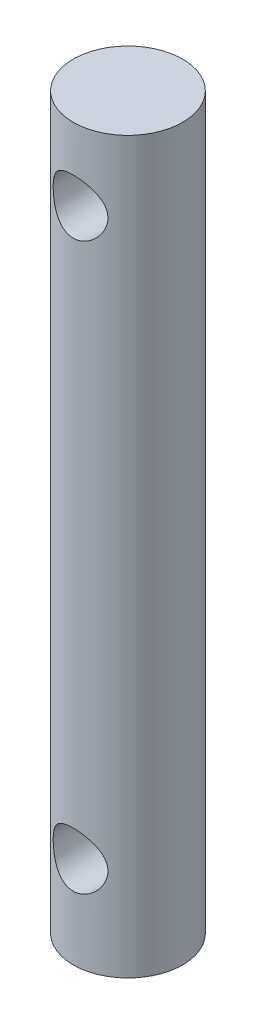
ISO-10303-21;
HEADER;
FILE_DESCRIPTION(('STEP AP214'),'2;1');
FILE_NAME('part.step','',(''),(''),'','','');
FILE_SCHEMA(('AUTOMOTIVE_DESIGN { 1 0 10303 214 1 1 1 1 }'));
ENDSEC;
DATA;
#1=APPLICATION_CONTEXT('core data for automotive mechanical design processes');
#2=APPLICATION_PROTOCOL_DEFINITION('international standard','automotive_design',2000,#1);
#3=PRODUCT_CONTEXT('',#1,'mechanical');
#4=PRODUCT('Part','Part','',(#3));
#5=PRODUCT_RELATED_PRODUCT_CATEGORY('part','',(#4));
#6=PRODUCT_DEFINITION_FORMATION('','',#4);
#7=PRODUCT_DEFINITION_CONTEXT('part definition',#1,'design');
#8=PRODUCT_DEFINITION('design','',#6,#7);
#9=PRODUCT_DEFINITION_SHAPE('','',#8);
#10=(LENGTH_UNIT() NAMED_UNIT(*) SI_UNIT(.MILLI.,.METRE.));
#11=(NAMED_UNIT(*) PLANE_ANGLE_UNIT() SI_UNIT($,.RADIAN.));
#12=(NAMED_UNIT(*) SI_UNIT($,.STERADIAN.) SOLID_ANGLE_UNIT());
#13=UNCERTAINTY_MEASURE_WITH_UNIT(LENGTH_MEASURE(1.E-05),#10,'distance_accuracy_value','');
#14=(GEOMETRIC_REPRESENTATION_CONTEXT(3) GLOBAL_UNCERTAINTY_ASSIGNED_CONTEXT((#13)) GLOBAL_UNIT_ASSIGNED_CONTEXT((#10,
#11,#12)) REPRESENTATION_CONTEXT('',''));
#15=CARTESIAN_POINT('',(0.,0.,0.));
#16=DIRECTION('',(0.,0.,1.));
#17=DIRECTION('',(1.,0.,0.));
#18=AXIS2_PLACEMENT_3D('',#15,#16,#17);
#19=CARTESIAN_POINT('',(0.,20.,0.));
#20=DIRECTION('',(0.,-1.,0.));
#21=DIRECTION('',(0.,0.,-1.));
#22=AXIS2_PLACEMENT_3D('',#19,#20,#21);
#23=CYLINDRICAL_SURFACE('',#22,3.);
#24=CARTESIAN_POINT('',(0.,17.5,-3.));
#25=CARTESIAN_POINT('',(-0.0788579444268501,17.4999950465242,-2.99999570107562));
#26=CARTESIAN_POINT('',(-0.157809899546344,17.4937448903184,-2.99685736529635));
#27=CARTESIAN_POINT('',(-0.313380352903344,17.4690206794877,-2.98461234055735));
#28=CARTESIAN_POINT('',(-0.389994130070444,17.4505234105033,-2.97549431743379));
#29=CARTESIAN_POINT('',(-0.538400317320674,17.4022092870751,-2.95224419105063));
#30=CARTESIAN_POINT('',(-0.61021020440872,17.372436423628,-2.93813158766306));
#31=CARTESIAN_POINT('',(-0.747708925209898,17.3026440679525,-2.90618664773642));
#32=CARTESIAN_POINT('',(-0.813398240985088,17.2626253836267,-2.88835460450288));
#33=CARTESIAN_POINT('',(-0.941261726642864,17.1707241257721,-2.84934387387093));
#34=CARTESIAN_POINT('',(-1.00298281668316,17.1182702811405,-2.82802798691306));
#35=CARTESIAN_POINT('',(-1.11716916730047,17.0042177811294,-2.78489955370114));
#36=CARTESIAN_POINT('',(-1.16962737466015,16.9426122223413,-2.76308664313552));
#37=CARTESIAN_POINT('',(-1.26787800067542,16.8062749757149,-2.71948426796021));
#38=CARTESIAN_POINT('',(-1.31283800332746,16.7308958524811,-2.69782780455198));
#39=CARTESIAN_POINT('',(-1.38925234033604,16.5724489960207,-2.65928968158481));
#40=CARTESIAN_POINT('',(-1.4207163224495,16.4893868069159,-2.64240461410484));
#41=CARTESIAN_POINT('',(-1.46719866328288,16.3230023418671,-2.61686800556713));
#42=CARTESIAN_POINT('',(-1.48308878562066,16.2399933218989,-2.6077840737557));
#43=CARTESIAN_POINT('',(-1.50064048996327,16.0720317433308,-2.59772834922792));
#44=CARTESIAN_POINT('',(-1.50231613255961,15.9870811886933,-2.59674854014932));
#45=CARTESIAN_POINT('',(-1.49203093075844,15.8285709635269,-2.60266395385873));
#46=CARTESIAN_POINT('',(-1.48167683930523,15.7548639531654,-2.6086314549302));
#47=CARTESIAN_POINT('',(-1.4504097735854,15.6104171359404,-2.62614343100775));
#48=CARTESIAN_POINT('',(-1.42949343584648,15.539678282042,-2.63768968247664));
#49=CARTESIAN_POINT('',(-1.37731467057901,15.4011563011515,-2.66531214619111));
#50=CARTESIAN_POINT('',(-1.34582260067399,15.3334804018213,-2.68148760995998));
#51=CARTESIAN_POINT('',(-1.273562531502,15.204048561115,-2.71655106422105));
#52=CARTESIAN_POINT('',(-1.2327903657187,15.1422952965999,-2.73544027170286));
#53=CARTESIAN_POINT('',(-1.13709908236918,15.0182181208852,-2.77669736854929));
#54=CARTESIAN_POINT('',(-1.08104168755392,14.9568146896358,-2.79920265355119));
#55=CARTESIAN_POINT('',(-0.959333368112061,14.8438968721136,-2.84321434950611));
#56=CARTESIAN_POINT('',(-0.893677884861429,14.7923872119492,-2.86472027938201));
#57=CARTESIAN_POINT('',(-0.750774758747774,14.6984715084554,-2.90552980924446));
#58=CARTESIAN_POINT('',(-0.673130387399115,14.6565992913314,-2.92468476243011));
#59=CARTESIAN_POINT('',(-0.510699323233196,14.5868544564355,-2.95736821681863));
#60=CARTESIAN_POINT('',(-0.425918364397914,14.5589707224772,-2.9709011841533));
#61=CARTESIAN_POINT('',(-0.259149737491053,14.520286894425,-2.98986500612153));
#62=CARTESIAN_POINT('',(-0.17751229582249,14.5082631463798,-2.99587407451965));
#63=CARTESIAN_POINT('',(-0.013169399924028,14.4978029032983,-3.00109520188655));
#64=CARTESIAN_POINT('',(0.0695355298048625,14.4993599715408,-3.00031048081978));
#65=CARTESIAN_POINT('',(0.22684945797898,14.5153100326281,-2.99236788380152));
#66=CARTESIAN_POINT('',(0.301589112074894,14.528698799095,-2.98570868532252));
#67=CARTESIAN_POINT('',(0.447610338452911,14.5663571078427,-2.9673325697226));
#68=CARTESIAN_POINT('',(0.51889152853663,14.5906278496802,-2.95561509501618));
#69=CARTESIAN_POINT('',(0.658332912674359,14.6499976996495,-2.92776377120382));
#70=CARTESIAN_POINT('',(0.726345595508705,14.6853865751744,-2.91151322654446));
#71=CARTESIAN_POINT('',(0.855692042548907,14.7656613034699,-2.87615961476126));
#72=CARTESIAN_POINT('',(0.917022944664887,14.8105512018931,-2.85705533350407));
#73=CARTESIAN_POINT('',(1.03765153393382,14.9136406379961,-2.81562332004297));
#74=CARTESIAN_POINT('',(1.09615811672854,14.9727143026677,-2.79316327265249));
#75=CARTESIAN_POINT('',(1.20278448167828,15.0998877269166,-2.7489358741323));
#76=CARTESIAN_POINT('',(1.25089707856781,15.1679936782719,-2.72716901100071));
#77=CARTESIAN_POINT('',(1.33756187171853,15.3154654812595,-2.68576788309734));
#78=CARTESIAN_POINT('',(1.37553824370037,15.3952168991417,-2.66628794383591));
#79=CARTESIAN_POINT('',(1.43712423890206,15.5612651013624,-2.63361108441202));
#80=CARTESIAN_POINT('',(1.46075237380052,15.6475532897003,-2.62040607332625));
#81=CARTESIAN_POINT('',(1.49079253120031,15.8153653343271,-2.60342251538703));
#82=CARTESIAN_POINT('',(1.49863949460818,15.8965513801529,-2.59886075197597));
#83=CARTESIAN_POINT('',(1.5010337315643,16.0591706007468,-2.59748031962405));
#84=CARTESIAN_POINT('',(1.49558676993486,16.1406036531068,-2.60065829439585));
#85=CARTESIAN_POINT('',(1.47288918838996,16.2932252523002,-2.61356793076615));
#86=CARTESIAN_POINT('',(1.45681247151455,16.3646507052171,-2.62264641723988));
#87=CARTESIAN_POINT('',(1.41476303733662,16.5037121791366,-2.64556524281479));
#88=CARTESIAN_POINT('',(1.38878713673988,16.571346973138,-2.65940711354503));
#89=CARTESIAN_POINT('',(1.32572361795085,16.7059372764798,-2.69142795546803));
#90=CARTESIAN_POINT('',(1.28800670672355,16.7725418527435,-2.70983583593881));
#91=CARTESIAN_POINT('',(1.20322645745609,16.8989118042719,-2.74852997452291));
#92=CARTESIAN_POINT('',(1.15615825686234,16.9586735957817,-2.76881720693416));
#93=CARTESIAN_POINT('',(1.04730498999206,17.077212973532,-2.81193484737138));
#94=CARTESIAN_POINT('',(0.984426634495894,17.1349886535254,-2.83477474959942));
#95=CARTESIAN_POINT('',(0.849232209349799,17.2393944751529,-2.87816628389896));
#96=CARTESIAN_POINT('',(0.776911084957798,17.2860186092049,-2.89871667939293));
#97=CARTESIAN_POINT('',(0.62389739517442,17.3668545440681,-2.93547014349806));
#98=CARTESIAN_POINT('',(0.543149255665098,17.4009762538547,-2.95164144740899));
#99=CARTESIAN_POINT('',(0.376113151707131,17.4547122516361,-2.9775201194848));
#100=CARTESIAN_POINT('',(0.28984169938365,17.4743677702086,-2.98724585044602));
#101=CARTESIAN_POINT('',(0.168902919736342,17.4908461166286,-2.99543192870217));
#102=CARTESIAN_POINT('',(0.135242819162347,17.4942739612995,-2.99714048010376));
#103=CARTESIAN_POINT('',(0.0677275977076376,17.4988519982711,-2.99942545465223));
#104=CARTESIAN_POINT('',(0.0338724714699428,17.5000021277053,-3.00000184655071));
#105=CARTESIAN_POINT('',(0.,17.5,-3.));
#106=B_SPLINE_CURVE_WITH_KNOTS('',3,(#24,#25,#26,#27,#28,#29,#30,#31,#32,#33,#34,#35,#36,#37,
#38,#39,#40,#41,#42,#43,#44,#45,#46,#47,#48,#49,#50,#51,#52,#53,#54,#55,#56,#57,#58,#59,#60,#61,
#62,#63,#64,#65,#66,#67,#68,#69,#70,#71,#72,#73,#74,#75,#76,#77,#78,#79,#80,#81,#82,#83,#84,#85,
#86,#87,#88,#89,#90,#91,#92,#93,#94,#95,#96,#97,#98,#99,#100,#101,#102,#103,#104,#105),
.UNSPECIFIED.,.T.,.F.,(4,2,2,2,2,2,2,2,2,2,2,2,2,2,2,2,2,2,2,2,2,2,2,2,2,2,2,2,2,2,2,2,2,2,2,2,
2,2,2,2,4),(0.,0.236436386130438,0.473322224563797,0.709293233238449,0.945245640872351,
1.19547263807713,1.44588935648105,1.71572589646129,1.98536921847421,2.23887018210344,
2.49212035993531,2.7150856861398,2.93812205888517,3.16635360252731,3.39468781890333,
3.65197412000818,3.90938301898029,4.17874533321661,4.44789325368419,4.69474935707018,
4.94148846767214,5.16910359759183,5.39674382446397,5.63089284041848,5.86514176122509,
6.12239415966628,6.37982382923148,6.64972023242589,6.91926767918176,7.1629396125457,
7.40650589797018,7.62686895373284,7.84730293182527,8.08254685170431,8.31791341715446,
8.58187864135757,8.84598575071869,9.1119602049529,9.37717362931724,9.47872920200875,
9.58028757766599),.UNSPECIFIED.);
#107=CARTESIAN_POINT('',(0.,17.5,-3.));
#108=VERTEX_POINT('',#107);
#109=EDGE_CURVE('E10',#108,#108,#106,.T.);
#110=ORIENTED_EDGE('',*,*,#109,.T.);
#111=EDGE_LOOP('',(#110));
#112=FACE_BOUND('',#111,.T.);
#113=CARTESIAN_POINT('',(1.5,16.,2.59807621135332));
#114=CARTESIAN_POINT('',(1.4999945446118,15.9218382877071,2.59808302092689));
#115=CARTESIAN_POINT('',(1.49384995609983,15.8435778827124,2.60165701781635));
#116=CARTESIAN_POINT('',(1.46958481484708,15.6894591029843,2.61543549678079));
#117=CARTESIAN_POINT('',(1.45143909683127,15.6136061274349,2.62565391083339));
#118=CARTESIAN_POINT('',(1.40414992304972,15.4668225034841,2.65124019908098));
#119=CARTESIAN_POINT('',(1.3750649287406,15.3958680212896,2.66658065209878));
#120=CARTESIAN_POINT('',(1.30690128806456,15.2598636970049,2.70063997225287));
#121=CARTESIAN_POINT('',(1.26782210105366,15.1948141746063,2.71935902214097));
#122=CARTESIAN_POINT('',(1.17699981079632,15.0665414071637,2.75995303586162));
#123=CARTESIAN_POINT('',(1.12447805421566,15.0039112964897,2.7819609545693));
#124=CARTESIAN_POINT('',(1.0098807114217,14.8878874173899,2.82557974178558));
#125=CARTESIAN_POINT('',(0.94780038867344,14.8344982561247,2.84719040746875));
#126=CARTESIAN_POINT('',(0.81073434512182,14.7349492732785,2.88932215429423));
#127=CARTESIAN_POINT('',(0.735160783518862,14.6895193482107,2.90967159627259));
#128=CARTESIAN_POINT('',(0.576235539899256,14.6122887201314,2.94526134149293));
#129=CARTESIAN_POINT('',(0.492888807207233,14.5804794157942,2.96050486775612));
#130=CARTESIAN_POINT('',(0.327067415888966,14.5337430080484,2.98320691866356));
#131=CARTESIAN_POINT('',(0.244952685733227,14.5177757104667,2.99114220331338));
#132=CARTESIAN_POINT('',(0.0788559430467726,14.4997508219874,3.000113757691));
#133=CARTESIAN_POINT('',(-0.00512490876560731,14.4976848148064,3.00115420176885));
#134=CARTESIAN_POINT('',(-0.164748786635624,14.5071200109555,2.99644472874675));
#135=CARTESIAN_POINT('',(-0.240481798765187,14.5174570232818,2.99127743838241));
#136=CARTESIAN_POINT('',(-0.388970657877483,14.549321265857,2.97561367889621));
#137=CARTESIAN_POINT('',(-0.461726281640888,14.5708493334643,2.96511681099591));
#138=CARTESIAN_POINT('',(-0.60346408735433,14.6246238491347,2.93957374931482));
#139=CARTESIAN_POINT('',(-0.672380135272767,14.6570144697581,2.92446662293799));
#140=CARTESIAN_POINT('',(-0.803965202269992,14.7313951243022,2.89106468980031));
#141=CARTESIAN_POINT('',(-0.866631973257969,14.7733885949535,2.87276874236226));
#142=CARTESIAN_POINT('',(-0.990260491347293,14.8703430272995,2.83266591598844));
#143=CARTESIAN_POINT('',(-1.05050111254404,14.926154542489,2.81069063997263));
#144=CARTESIAN_POINT('',(-1.16115655544667,15.0468845873953,2.76681510880217));
#145=CARTESIAN_POINT('',(-1.21156381736135,15.1118100584111,2.74491492398443));
#146=CARTESIAN_POINT('',(-1.30425800196332,15.2539722886361,2.70216234138727));
#147=CARTESIAN_POINT('',(-1.34582597246708,15.3317290345813,2.68146479986061));
#148=CARTESIAN_POINT('',(-1.41497866950185,15.4944065070385,2.64563175417864));
#149=CARTESIAN_POINT('',(-1.44257798731634,15.5793196495263,2.63049045069101));
#150=CARTESIAN_POINT('',(-1.48077031653756,15.7468217669242,2.60916953725551));
#151=CARTESIAN_POINT('',(-1.49253768317996,15.8290616785653,2.60237483772744));
#152=CARTESIAN_POINT('',(-1.50227541991714,15.9946020122748,2.59676879042414));
#153=CARTESIAN_POINT('',(-1.50025553597254,16.0779016436797,2.59795180333967));
#154=CARTESIAN_POINT('',(-1.48355406501595,16.2334808778681,2.60751504810877));
#155=CARTESIAN_POINT('',(-1.4702817250687,16.3059691766619,2.61509381259981));
#156=CARTESIAN_POINT('',(-1.43354442694866,16.4475516794064,2.63541032327011));
#157=CARTESIAN_POINT('',(-1.41007616793542,16.5166447761199,2.64814974007551));
#158=CARTESIAN_POINT('',(-1.35247138290733,16.653116996354,2.67804333119485));
#159=CARTESIAN_POINT('',(-1.31789109553909,16.7202685252803,2.69537464864595));
#160=CARTESIAN_POINT('',(-1.23943059602371,16.8482039073085,2.73234179245874));
#161=CARTESIAN_POINT('',(-1.19554560649832,16.9089844652699,2.75197880032721));
#162=CARTESIAN_POINT('',(-1.09325575079828,17.0304681512853,2.79431997684504));
#163=CARTESIAN_POINT('',(-1.03371790847245,17.0901957260765,2.81709874731433));
#164=CARTESIAN_POINT('',(-0.905106743097434,17.1991183569904,2.86101352466839));
#165=CARTESIAN_POINT('',(-0.836030211983022,17.2483098553458,2.88214897511564));
#166=CARTESIAN_POINT('',(-0.687803043838137,17.3358605889252,2.92112042536435));
#167=CARTESIAN_POINT('',(-0.608434646361171,17.3738996773164,2.93885462508044));
#168=CARTESIAN_POINT('',(-0.443283546961624,17.4357068557861,2.96825032438951));
#169=CARTESIAN_POINT('',(-0.357506552088265,17.4594874770495,2.97991715514559));
#170=CARTESIAN_POINT('',(-0.190469523495627,17.490052846262,2.99501262272824));
#171=CARTESIAN_POINT('',(-0.109517165775687,17.4981968138142,2.99909891862287));
#172=CARTESIAN_POINT('',(0.0526889789268045,17.5012648981816,3.00063195562697));
#173=CARTESIAN_POINT('',(0.133942650442629,17.4961936427854,2.99808102100335));
#174=CARTESIAN_POINT('',(0.28880698847572,17.4738753898066,2.98700953256884));
#175=CARTESIAN_POINT('',(0.362568476716895,17.4574527261135,2.97889342001985));
#176=CARTESIAN_POINT('',(0.506168928275426,17.4140095010455,2.95788140495135));
#177=CARTESIAN_POINT('',(0.576007327433263,17.3869874198598,2.94498481699193));
#178=CARTESIAN_POINT('',(0.713135109367326,17.321909421751,2.9148889612218));
#179=CARTESIAN_POINT('',(0.780187714050068,17.2834310151882,2.89752925798199));
#180=CARTESIAN_POINT('',(0.907161962721036,17.1970631037114,2.86032199712739));
#181=CARTESIAN_POINT('',(0.96708031112236,17.1491692763265,2.84047329837541));
#182=CARTESIAN_POINT('',(1.08437100623534,17.0398042914659,2.79792915339941));
#183=CARTESIAN_POINT('',(1.14089652680891,16.9774562687842,2.77514698517547));
#184=CARTESIAN_POINT('',(1.24299493109201,16.8438239183053,2.73094614244278));
#185=CARTESIAN_POINT('',(1.28855812501509,16.7725317686985,2.70952868642798));
#186=CARTESIAN_POINT('',(1.36864661967848,16.6200450301286,2.66999407957374));
#187=CARTESIAN_POINT('',(1.40277759894141,16.5386087033069,2.65200261384405));
#188=CARTESIAN_POINT('',(1.45631806425962,16.3700013934903,2.62299234492527));
#189=CARTESIAN_POINT('',(1.47577678676302,16.282850666631,2.61195024221553));
#190=CARTESIAN_POINT('',(1.49155051179662,16.162291966522,2.60293908902686));
#191=CARTESIAN_POINT('',(1.49471415744578,16.1299481584032,2.60112193507727));
#192=CARTESIAN_POINT('',(1.49894010763494,16.0650752789766,2.59868903831625));
#193=CARTESIAN_POINT('',(1.50000227159981,16.0325461954212,2.59807337587664));
#194=CARTESIAN_POINT('',(1.5,16.,2.59807621135332));
#195=B_SPLINE_CURVE_WITH_KNOTS('',3,(#113,#114,#115,#116,#117,#118,#119,#120,#121,#122,#123,
#124,#125,#126,#127,#128,#129,#130,#131,#132,#133,#134,#135,#136,#137,#138,#139,#140,#141,#142,
#143,#144,#145,#146,#147,#148,#149,#150,#151,#152,#153,#154,#155,#156,#157,#158,#159,#160,#161,
#162,#163,#164,#165,#166,#167,#168,#169,#170,#171,#172,#173,#174,#175,#176,#177,#178,#179,#180,
#181,#182,#183,#184,#185,#186,#187,#188,#189,#190,#191,#192,#193,#194),.UNSPECIFIED.,.T.,.F.,(4,
2,2,2,2,2,2,2,2,2,2,2,2,2,2,2,2,2,2,2,2,2,2,2,2,2,2,2,2,2,2,2,2,2,2,2,2,2,2,2,4),(0.,
0.234348183892075,0.469189339237207,0.702792893878329,0.936409088167724,1.18929346874735,
1.44230356626557,1.71236838358145,1.98226240445837,2.23295227451903,2.4834903552906,
2.71224146226808,2.94100968776183,3.1729430209672,3.40495949025408,3.65890787185336,
3.91305072368878,4.18333262594173,4.45333161317558,4.70193436281318,4.9503613978256,
5.17161275136038,5.39293578654095,5.62450944609132,5.85620229330071,6.1171011537092,
6.37808797467303,6.64596272119449,6.91360169713157,7.1566840558423,7.39968130190957,
7.62666637307239,7.8536840026802,8.09041126079208,8.32724745151079,8.58765362775102,
8.84828914267731,9.11716123557908,9.38512699504141,9.48270202777964,9.58028358741811),.UNSPECIFIED.);
#196=CARTESIAN_POINT('',(1.5,16.,2.59807621135332));
#197=VERTEX_POINT('',#196);
#198=EDGE_CURVE('E42',#197,#197,#195,.T.);
#199=ORIENTED_EDGE('',*,*,#198,.T.);
#200=EDGE_LOOP('',(#199));
#201=FACE_BOUND('',#200,.T.);
#202=CARTESIAN_POINT('',(0.,-13.5,-3.));
#203=CARTESIAN_POINT('',(-0.0788579444268503,-13.5000049534758,-2.99999570107562));
#204=CARTESIAN_POINT('',(-0.157809899546344,-13.5062551096816,-2.99685736529635));
#205=CARTESIAN_POINT('',(-0.313380352903344,-13.5309793205123,-2.98461234055735));
#206=CARTESIAN_POINT('',(-0.389994130070444,-13.5494765894967,-2.97549431743379));
#207=CARTESIAN_POINT('',(-0.538400317320673,-13.5977907129249,-2.95224419105063));
#208=CARTESIAN_POINT('',(-0.610210204408719,-13.627563576372,-2.93813158766306));
#209=CARTESIAN_POINT('',(-0.747708925209898,-13.6973559320475,-2.90618664773642));
#210=CARTESIAN_POINT('',(-0.813398240985089,-13.7373746163733,-2.88835460450288));
#211=CARTESIAN_POINT('',(-0.941261726642864,-13.8292758742279,-2.84934387387093));
#212=CARTESIAN_POINT('',(-1.00298281668316,-13.8817297188595,-2.82802798691306));
#213=CARTESIAN_POINT('',(-1.11716916730047,-13.9957822188706,-2.78489955370114));
#214=CARTESIAN_POINT('',(-1.16962737466015,-14.0573877776587,-2.76308664313552));
#215=CARTESIAN_POINT('',(-1.26787800067542,-14.1937250242851,-2.71948426796021));
#216=CARTESIAN_POINT('',(-1.31283800332746,-14.2691041475189,-2.69782780455198));
#217=CARTESIAN_POINT('',(-1.38925234033604,-14.4275510039793,-2.65928968158481));
#218=CARTESIAN_POINT('',(-1.4207163224495,-14.5106131930841,-2.64240461410484));
#219=CARTESIAN_POINT('',(-1.46719866328288,-14.6769976581329,-2.61686800556713));
#220=CARTESIAN_POINT('',(-1.48308878562066,-14.7600066781011,-2.6077840737557));
#221=CARTESIAN_POINT('',(-1.50064048996327,-14.9279682566692,-2.59772834922792));
#222=CARTESIAN_POINT('',(-1.50231613255961,-15.0129188113067,-2.59674854014932));
#223=CARTESIAN_POINT('',(-1.49203093075844,-15.1714290364731,-2.60266395385873));
#224=CARTESIAN_POINT('',(-1.48167683930523,-15.2451360468346,-2.6086314549302));
#225=CARTESIAN_POINT('',(-1.4504097735854,-15.3895828640596,-2.62614343100775));
#226=CARTESIAN_POINT('',(-1.42949343584648,-15.460321717958,-2.63768968247664));
#227=CARTESIAN_POINT('',(-1.37731467057901,-15.5988436988485,-2.66531214619111));
#228=CARTESIAN_POINT('',(-1.34582260067399,-15.6665195981787,-2.68148760995998));
#229=CARTESIAN_POINT('',(-1.27356253150201,-15.795951438885,-2.71655106422105));
#230=CARTESIAN_POINT('',(-1.2327903657187,-15.8577047034001,-2.73544027170286));
#231=CARTESIAN_POINT('',(-1.13709908236918,-15.9817818791148,-2.77669736854929));
#232=CARTESIAN_POINT('',(-1.08104168755392,-16.0431853103642,-2.79920265355119));
#233=CARTESIAN_POINT('',(-0.959333368112062,-16.1561031278864,-2.84321434950611));
#234=CARTESIAN_POINT('',(-0.893677884861429,-16.2076127880508,-2.86472027938201));
#235=CARTESIAN_POINT('',(-0.750774758747773,-16.3015284915446,-2.90552980924446));
#236=CARTESIAN_POINT('',(-0.673130387399113,-16.3434007086686,-2.92468476243011));
#237=CARTESIAN_POINT('',(-0.510699323233195,-16.4131455435645,-2.95736821681863));
#238=CARTESIAN_POINT('',(-0.425918364397914,-16.4410292775228,-2.9709011841533));
#239=CARTESIAN_POINT('',(-0.259149737491053,-16.479713105575,-2.98986500612153));
#240=CARTESIAN_POINT('',(-0.177512295822489,-16.4917368536202,-2.99587407451965));
#241=CARTESIAN_POINT('',(-0.013169399924027,-16.5021970967017,-3.00109520188655));
#242=CARTESIAN_POINT('',(0.0695355298048635,-16.5006400284592,-3.00031048081978));
#243=CARTESIAN_POINT('',(0.226849457978981,-16.4846899673719,-2.99236788380152));
#244=CARTESIAN_POINT('',(0.301589112074895,-16.471301200905,-2.98570868532252));
#245=CARTESIAN_POINT('',(0.447610338452911,-16.4336428921573,-2.9673325697226));
#246=CARTESIAN_POINT('',(0.51889152853663,-16.4093721503198,-2.95561509501618));
#247=CARTESIAN_POINT('',(0.658332912674359,-16.3500023003504,-2.92776377120382));
#248=CARTESIAN_POINT('',(0.726345595508705,-16.3146134248256,-2.91151322654446));
#249=CARTESIAN_POINT('',(0.855692042548908,-16.2343386965301,-2.87615961476126));
#250=CARTESIAN_POINT('',(0.917022944664888,-16.1894487981069,-2.85705533350407));
#251=CARTESIAN_POINT('',(1.03765153393382,-16.0863593620039,-2.81562332004297));
#252=CARTESIAN_POINT('',(1.09615811672854,-16.0272856973323,-2.79316327265249));
#253=CARTESIAN_POINT('',(1.20278448167828,-15.9001122730834,-2.7489358741323));
#254=CARTESIAN_POINT('',(1.25089707856781,-15.8320063217281,-2.7271690110007));
#255=CARTESIAN_POINT('',(1.33756187171853,-15.6845345187405,-2.68576788309734));
#256=CARTESIAN_POINT('',(1.37553824370037,-15.6047831008583,-2.66628794383591));
#257=CARTESIAN_POINT('',(1.43712423890206,-15.4387348986375,-2.63361108441202));
#258=CARTESIAN_POINT('',(1.46075237380053,-15.3524467102997,-2.62040607332625));
#259=CARTESIAN_POINT('',(1.49079253120031,-15.1846346656729,-2.60342251538703));
#260=CARTESIAN_POINT('',(1.49863949460818,-15.1034486198471,-2.59886075197597));
#261=CARTESIAN_POINT('',(1.5010337315643,-14.9408293992532,-2.59748031962405));
#262=CARTESIAN_POINT('',(1.49558676993486,-14.8593963468932,-2.60065829439585));
#263=CARTESIAN_POINT('',(1.47288918838996,-14.7067747476998,-2.61356793076615));
#264=CARTESIAN_POINT('',(1.45681247151455,-14.6353492947829,-2.62264641723988));
#265=CARTESIAN_POINT('',(1.41476303733662,-14.4962878208634,-2.64556524281479));
#266=CARTESIAN_POINT('',(1.38878713673988,-14.428653026862,-2.65940711354503));
#267=CARTESIAN_POINT('',(1.32572361795085,-14.2940627235202,-2.69142795546803));
#268=CARTESIAN_POINT('',(1.28800670672355,-14.2274581472565,-2.70983583593881));
#269=CARTESIAN_POINT('',(1.20322645745609,-14.1010881957281,-2.74852997452291));
#270=CARTESIAN_POINT('',(1.15615825686234,-14.0413264042183,-2.76881720693416));
#271=CARTESIAN_POINT('',(1.04730498999206,-13.922787026468,-2.81193484737138));
#272=CARTESIAN_POINT('',(0.984426634495892,-13.8650113464746,-2.83477474959942));
#273=CARTESIAN_POINT('',(0.849232209349796,-13.7606055248471,-2.87816628389896));
#274=CARTESIAN_POINT('',(0.776911084957796,-13.7139813907951,-2.89871667939293));
#275=CARTESIAN_POINT('',(0.623897395174418,-13.6331454559319,-2.93547014349806));
#276=CARTESIAN_POINT('',(0.543149255665095,-13.5990237461453,-2.95164144740899));
#277=CARTESIAN_POINT('',(0.376113151707129,-13.5452877483639,-2.9775201194848));
#278=CARTESIAN_POINT('',(0.28984169938365,-13.5256322297914,-2.98724585044602));
#279=CARTESIAN_POINT('',(0.168902919736343,-13.5091538833714,-2.99543192870217));
#280=CARTESIAN_POINT('',(0.135242819162348,-13.5057260387005,-2.99714048010376));
#281=CARTESIAN_POINT('',(0.067727597707638,-13.5011480017289,-2.99942545465223));
#282=CARTESIAN_POINT('',(0.033872471469943,-13.4999978722947,-3.00000184655071));
#283=CARTESIAN_POINT('',(0.,-13.5,-3.));
#284=B_SPLINE_CURVE_WITH_KNOTS('',3,(#202,#203,#204,#205,#206,#207,#208,#209,#210,#211,#212,
#213,#214,#215,#216,#217,#218,#219,#220,#221,#222,#223,#224,#225,#226,#227,#228,#229,#230,#231,
#232,#233,#234,#235,#236,#237,#238,#239,#240,#241,#242,#243,#244,#245,#246,#247,#248,#249,#250,
#251,#252,#253,#254,#255,#256,#257,#258,#259,#260,#261,#262,#263,#264,#265,#266,#267,#268,#269,
#270,#271,#272,#273,#274,#275,#276,#277,#278,#279,#280,#281,#282,#283),.UNSPECIFIED.,.T.,.F.,(4,
2,2,2,2,2,2,2,2,2,2,2,2,2,2,2,2,2,2,2,2,2,2,2,2,2,2,2,2,2,2,2,2,2,2,2,2,2,2,2,4),(0.,
0.236436386130439,0.473322224563796,0.709293233238447,0.945245640872352,1.19547263807713,
1.44588935648105,1.71572589646129,1.98536921847421,2.23887018210344,2.49212035993531,
2.71508568613981,2.93812205888518,3.16635360252731,3.39468781890332,3.65197412000818,
3.90938301898029,4.17874533321661,4.44789325368419,4.69474935707018,4.94148846767214,
5.16910359759183,5.39674382446397,5.63089284041848,5.86514176122509,6.12239415966628,
6.37982382923148,6.64972023242589,6.91926767918176,7.1629396125457,7.40650589797018,
7.62686895373284,7.84730293182527,8.08254685170431,8.31791341715446,8.58187864135757,
8.84598575071869,9.1119602049529,9.37717362931724,9.47872920200875,9.58028757766599),.UNSPECIFIED.);
#285=CARTESIAN_POINT('',(0.,-13.5,-3.));
#286=VERTEX_POINT('',#285);
#287=EDGE_CURVE('E46',#286,#286,#284,.T.);
#288=ORIENTED_EDGE('',*,*,#287,.T.);
#289=EDGE_LOOP('',(#288));
#290=FACE_BOUND('',#289,.T.);
#291=CARTESIAN_POINT('',(1.5,-15.,2.59807621135332));
#292=CARTESIAN_POINT('',(1.4999945446118,-15.0781617122929,2.59808302092689));
#293=CARTESIAN_POINT('',(1.49384995609983,-15.1564221172876,2.60165701781635));
#294=CARTESIAN_POINT('',(1.46958481484708,-15.3105408970157,2.61543549678079));
#295=CARTESIAN_POINT('',(1.45143909683127,-15.3863938725651,2.62565391083339));
#296=CARTESIAN_POINT('',(1.40414992304972,-15.5331774965159,2.65124019908098));
#297=CARTESIAN_POINT('',(1.3750649287406,-15.6041319787104,2.66658065209878));
#298=CARTESIAN_POINT('',(1.30690128806456,-15.7401363029951,2.70063997225287));
#299=CARTESIAN_POINT('',(1.26782210105366,-15.8051858253937,2.71935902214097));
#300=CARTESIAN_POINT('',(1.17699981079632,-15.9334585928363,2.75995303586162));
#301=CARTESIAN_POINT('',(1.12447805421566,-15.9960887035103,2.7819609545693));
#302=CARTESIAN_POINT('',(1.0098807114217,-16.1121125826101,2.82557974178558));
#303=CARTESIAN_POINT('',(0.947800388673439,-16.1655017438753,2.84719040746875));
#304=CARTESIAN_POINT('',(0.810734345121819,-16.2650507267215,2.88932215429424));
#305=CARTESIAN_POINT('',(0.735160783518862,-16.3104806517893,2.90967159627259));
#306=CARTESIAN_POINT('',(0.576235539899256,-16.3877112798686,2.94526134149293));
#307=CARTESIAN_POINT('',(0.492888807207234,-16.4195205842058,2.96050486775612));
#308=CARTESIAN_POINT('',(0.327067415888967,-16.4662569919516,2.98320691866356));
#309=CARTESIAN_POINT('',(0.244952685733227,-16.4822242895333,2.99114220331338));
#310=CARTESIAN_POINT('',(0.0788559430467726,-16.5002491780126,3.000113757691));
#311=CARTESIAN_POINT('',(-0.00512490876560765,-16.5023151851936,3.00115420176885));
#312=CARTESIAN_POINT('',(-0.164748786635625,-16.4928799890445,2.99644472874675));
#313=CARTESIAN_POINT('',(-0.240481798765187,-16.4825429767182,2.99127743838241));
#314=CARTESIAN_POINT('',(-0.388970657877483,-16.450678734143,2.97561367889621));
#315=CARTESIAN_POINT('',(-0.461726281640888,-16.4291506665357,2.96511681099591));
#316=CARTESIAN_POINT('',(-0.60346408735433,-16.3753761508653,2.93957374931482));
#317=CARTESIAN_POINT('',(-0.672380135272767,-16.3429855302419,2.92446662293799));
#318=CARTESIAN_POINT('',(-0.803965202269992,-16.2686048756978,2.89106468980031));
#319=CARTESIAN_POINT('',(-0.866631973257968,-16.2266114050465,2.87276874236226));
#320=CARTESIAN_POINT('',(-0.990260491347292,-16.1296569727005,2.83266591598844));
#321=CARTESIAN_POINT('',(-1.05050111254404,-16.073845457511,2.81069063997263));
#322=CARTESIAN_POINT('',(-1.16115655544667,-15.9531154126047,2.76681510880217));
#323=CARTESIAN_POINT('',(-1.21156381736135,-15.8881899415889,2.74491492398443));
#324=CARTESIAN_POINT('',(-1.30425800196332,-15.7460277113639,2.70216234138727));
#325=CARTESIAN_POINT('',(-1.34582597246708,-15.6682709654187,2.68146479986061));
#326=CARTESIAN_POINT('',(-1.41497866950185,-15.5055934929615,2.64563175417864));
#327=CARTESIAN_POINT('',(-1.44257798731633,-15.4206803504737,2.63049045069101));
#328=CARTESIAN_POINT('',(-1.48077031653756,-15.2531782330758,2.60916953725551));
#329=CARTESIAN_POINT('',(-1.49253768317996,-15.1709383214347,2.60237483772744));
#330=CARTESIAN_POINT('',(-1.50227541991714,-15.0053979877252,2.59676879042414));
#331=CARTESIAN_POINT('',(-1.50025553597254,-14.9220983563203,2.59795180333967));
#332=CARTESIAN_POINT('',(-1.48355406501595,-14.7665191221319,2.60751504810877));
#333=CARTESIAN_POINT('',(-1.4702817250687,-14.6940308233381,2.61509381259981));
#334=CARTESIAN_POINT('',(-1.43354442694866,-14.5524483205936,2.63541032327011));
#335=CARTESIAN_POINT('',(-1.41007616793542,-14.4833552238801,2.64814974007551));
#336=CARTESIAN_POINT('',(-1.35247138290733,-14.346883003646,2.67804333119485));
#337=CARTESIAN_POINT('',(-1.31789109553909,-14.2797314747197,2.69537464864595));
#338=CARTESIAN_POINT('',(-1.23943059602371,-14.1517960926915,2.73234179245874));
#339=CARTESIAN_POINT('',(-1.19554560649832,-14.0910155347301,2.75197880032721));
#340=CARTESIAN_POINT('',(-1.09325575079828,-13.9695318487147,2.79431997684504));
#341=CARTESIAN_POINT('',(-1.03371790847245,-13.9098042739235,2.81709874731433));
#342=CARTESIAN_POINT('',(-0.905106743097434,-13.8008816430096,2.86101352466839));
#343=CARTESIAN_POINT('',(-0.836030211983022,-13.7516901446542,2.88214897511564));
#344=CARTESIAN_POINT('',(-0.687803043838138,-13.6641394110748,2.92112042536435));
#345=CARTESIAN_POINT('',(-0.608434646361172,-13.6261003226836,2.93885462508044));
#346=CARTESIAN_POINT('',(-0.443283546961626,-13.5642931442139,2.96825032438951));
#347=CARTESIAN_POINT('',(-0.357506552088266,-13.5405125229505,2.97991715514559));
#348=CARTESIAN_POINT('',(-0.190469523495627,-13.509947153738,2.99501262272824));
#349=CARTESIAN_POINT('',(-0.109517165775687,-13.5018031861858,2.99909891862287));
#350=CARTESIAN_POINT('',(0.0526889789268044,-13.4987351018184,3.00063195562697));
#351=CARTESIAN_POINT('',(0.133942650442629,-13.5038063572147,2.99808102100335));
#352=CARTESIAN_POINT('',(0.28880698847572,-13.5261246101934,2.98700953256884));
#353=CARTESIAN_POINT('',(0.362568476716895,-13.5425472738865,2.97889342001985));
#354=CARTESIAN_POINT('',(0.506168928275426,-13.5859904989545,2.95788140495135));
#355=CARTESIAN_POINT('',(0.576007327433262,-13.6130125801402,2.94498481699193));
#356=CARTESIAN_POINT('',(0.713135109367326,-13.678090578249,2.9148889612218));
#357=CARTESIAN_POINT('',(0.780187714050068,-13.7165689848118,2.89752925798199));
#358=CARTESIAN_POINT('',(0.907161962721036,-13.8029368962886,2.86032199712739));
#359=CARTESIAN_POINT('',(0.96708031112236,-13.8508307236735,2.84047329837541));
#360=CARTESIAN_POINT('',(1.08437100623534,-13.9601957085341,2.79792915339941));
#361=CARTESIAN_POINT('',(1.14089652680891,-14.0225437312158,2.77514698517547));
#362=CARTESIAN_POINT('',(1.24299493109201,-14.1561760816947,2.73094614244278));
#363=CARTESIAN_POINT('',(1.28855812501509,-14.2274682313015,2.70952868642798));
#364=CARTESIAN_POINT('',(1.36864661967848,-14.3799549698714,2.66999407957374));
#365=CARTESIAN_POINT('',(1.40277759894141,-14.4613912966931,2.65200261384405));
#366=CARTESIAN_POINT('',(1.45631806425962,-14.6299986065097,2.62299234492527));
#367=CARTESIAN_POINT('',(1.47577678676302,-14.717149333369,2.61195024221553));
#368=CARTESIAN_POINT('',(1.49155051179662,-14.837708033478,2.60293908902686));
#369=CARTESIAN_POINT('',(1.49471415744578,-14.8700518415968,2.60112193507727));
#370=CARTESIAN_POINT('',(1.49894010763494,-14.9349247210234,2.59868903831625));
#371=CARTESIAN_POINT('',(1.50000227159981,-14.9674538045788,2.59807337587664));
#372=CARTESIAN_POINT('',(1.5,-15.,2.59807621135332));
#373=B_SPLINE_CURVE_WITH_KNOTS('',3,(#291,#292,#293,#294,#295,#296,#297,#298,#299,#300,#301,
#302,#303,#304,#305,#306,#307,#308,#309,#310,#311,#312,#313,#314,#315,#316,#317,#318,#319,#320,
#321,#322,#323,#324,#325,#326,#327,#328,#329,#330,#331,#332,#333,#334,#335,#336,#337,#338,#339,
#340,#341,#342,#343,#344,#345,#346,#347,#348,#349,#350,#351,#352,#353,#354,#355,#356,#357,#358,
#359,#360,#361,#362,#363,#364,#365,#366,#367,#368,#369,#370,#371,#372),.UNSPECIFIED.,.T.,.F.,(4,
2,2,2,2,2,2,2,2,2,2,2,2,2,2,2,2,2,2,2,2,2,2,2,2,2,2,2,2,2,2,2,2,2,2,2,2,2,2,2,4),(0.,
0.234348183892073,0.469189339237207,0.702792893878327,0.936409088167727,1.18929346874735,
1.44230356626557,1.71236838358145,1.98226240445836,2.23295227451903,2.4834903552906,
2.71224146226808,2.94100968776183,3.1729430209672,3.40495949025408,3.65890787185336,
3.91305072368878,4.18333262594173,4.45333161317557,4.70193436281318,4.95036139782559,
5.17161275136038,5.39293578654094,5.62450944609131,5.85620229330071,6.1171011537092,
6.37808797467303,6.64596272119448,6.91360169713157,7.1566840558423,7.39968130190957,
7.62666637307239,7.85368400268019,8.09041126079208,8.32724745151079,8.58765362775101,
8.84828914267731,9.11716123557907,9.3851269950414,9.48270202777964,9.58028358741811),.UNSPECIFIED.);
#374=CARTESIAN_POINT('',(1.5,-15.,2.59807621135332));
#375=VERTEX_POINT('',#374);
#376=EDGE_CURVE('E50',#375,#375,#373,.T.);
#377=ORIENTED_EDGE('',*,*,#376,.T.);
#378=EDGE_LOOP('',(#377));
#379=FACE_BOUND('',#378,.T.);
#380=CARTESIAN_POINT('',(0.,20.,0.));
#381=DIRECTION('',(0.,1.,0.));
#382=DIRECTION('',(0.,0.,1.));
#383=AXIS2_PLACEMENT_3D('',#380,#381,#382);
#384=CIRCLE('',#383,3.);
#385=CARTESIAN_POINT('',(0.,20.,3.));
#386=VERTEX_POINT('',#385);
#387=EDGE_CURVE('E78',#386,#386,#384,.T.);
#388=ORIENTED_EDGE('',*,*,#387,.F.);
#389=EDGE_LOOP('',(#388));
#390=FACE_BOUND('',#389,.T.);
#391=CARTESIAN_POINT('',(0.,-20.,0.));
#392=DIRECTION('',(0.,1.,0.));
#393=DIRECTION('',(0.,0.,1.));
#394=AXIS2_PLACEMENT_3D('',#391,#392,#393);
#395=CIRCLE('',#394,3.);
#396=CARTESIAN_POINT('',(0.,-20.,3.));
#397=VERTEX_POINT('',#396);
#398=EDGE_CURVE('E79',#397,#397,#395,.T.);
#399=ORIENTED_EDGE('',*,*,#398,.T.);
#400=EDGE_LOOP('',(#399));
#401=FACE_BOUND('',#400,.T.);
#402=ADVANCED_FACE('F31',(#112,#201,#290,#379,#390,#401),#23,.T.);
#403=CARTESIAN_POINT('',(0.,20.,0.));
#404=DIRECTION('',(0.,1.,0.));
#405=DIRECTION('',(0.,0.,1.));
#406=AXIS2_PLACEMENT_3D('',#403,#404,#405);
#407=PLANE('',#406);
#408=ORIENTED_EDGE('',*,*,#387,.T.);
#409=EDGE_LOOP('',(#408));
#410=FACE_BOUND('',#409,.T.);
#411=ADVANCED_FACE('F71',(#410),#407,.T.);
#412=CARTESIAN_POINT('',(0.,-20.,0.));
#413=DIRECTION('',(0.,1.,0.));
#414=DIRECTION('',(0.,0.,1.));
#415=AXIS2_PLACEMENT_3D('',#412,#413,#414);
#416=PLANE('',#415);
#417=ORIENTED_EDGE('',*,*,#398,.F.);
#418=EDGE_LOOP('',(#417));
#419=FACE_BOUND('',#418,.T.);
#420=ADVANCED_FACE('F69',(#419),#416,.F.);
#421=CARTESIAN_POINT('',(0.,-15.,-3.));
#422=DIRECTION('',(0.,0.,1.));
#423=DIRECTION('',(1.,0.,0.));
#424=AXIS2_PLACEMENT_3D('',#421,#422,#423);
#425=CYLINDRICAL_SURFACE('',#424,1.5);
#426=ORIENTED_EDGE('',*,*,#376,.F.);
#427=EDGE_LOOP('',(#426));
#428=FACE_BOUND('',#427,.T.);
#429=ORIENTED_EDGE('',*,*,#287,.F.);
#430=EDGE_LOOP('',(#429));
#431=FACE_BOUND('',#430,.T.);
#432=ADVANCED_FACE('F63',(#428,#431),#425,.F.);
#433=CARTESIAN_POINT('',(0.,16.,-3.));
#434=DIRECTION('',(0.,0.,1.));
#435=DIRECTION('',(1.,0.,0.));
#436=AXIS2_PLACEMENT_3D('',#433,#434,#435);
#437=CYLINDRICAL_SURFACE('',#436,1.5);
#438=ORIENTED_EDGE('',*,*,#198,.F.);
#439=EDGE_LOOP('',(#438));
#440=FACE_BOUND('',#439,.T.);
#441=ORIENTED_EDGE('',*,*,#109,.F.);
#442=EDGE_LOOP('',(#441));
#443=FACE_BOUND('',#442,.T.);
#444=ADVANCED_FACE('F60',(#440,#443),#437,.F.);
#445=CLOSED_SHELL('',(#402,#411,#420,#432,#444));
#446=MANIFOLD_SOLID_BREP('B2',#445);
#447=ADVANCED_BREP_SHAPE_REPRESENTATION('',(#18,#446),#14);
#448=SHAPE_DEFINITION_REPRESENTATION(#9,#447);
ENDSEC;
END-ISO-10303-21;
